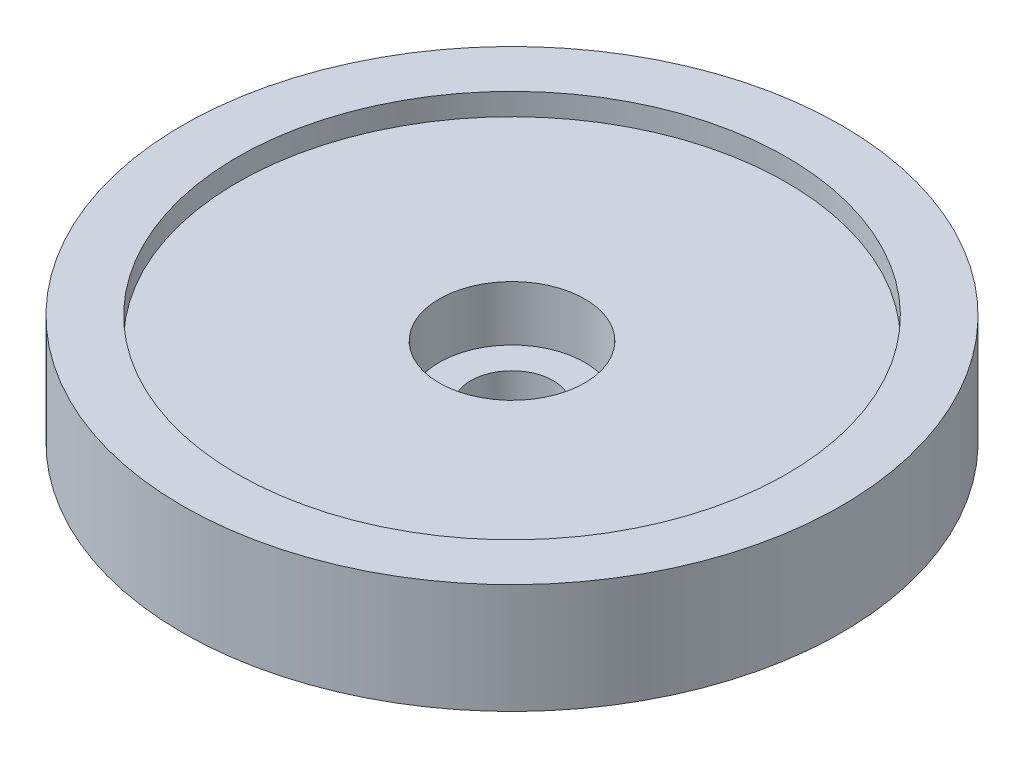
ISO-10303-21;
HEADER;
FILE_DESCRIPTION(('STEP AP214'),'2;1');
FILE_NAME('part.step','',(''),(''),'','','');
FILE_SCHEMA(('AUTOMOTIVE_DESIGN { 1 0 10303 214 1 1 1 1 }'));
ENDSEC;
DATA;
#1=APPLICATION_CONTEXT('core data for automotive mechanical design processes');
#2=APPLICATION_PROTOCOL_DEFINITION('international standard','automotive_design',2000,#1);
#3=PRODUCT_CONTEXT('',#1,'mechanical');
#4=PRODUCT('Part','Part','',(#3));
#5=PRODUCT_RELATED_PRODUCT_CATEGORY('part','',(#4));
#6=PRODUCT_DEFINITION_FORMATION('','',#4);
#7=PRODUCT_DEFINITION_CONTEXT('part definition',#1,'design');
#8=PRODUCT_DEFINITION('design','',#6,#7);
#9=PRODUCT_DEFINITION_SHAPE('','',#8);
#10=(LENGTH_UNIT() NAMED_UNIT(*) SI_UNIT(.MILLI.,.METRE.));
#11=(NAMED_UNIT(*) PLANE_ANGLE_UNIT() SI_UNIT($,.RADIAN.));
#12=(NAMED_UNIT(*) SI_UNIT($,.STERADIAN.) SOLID_ANGLE_UNIT());
#13=UNCERTAINTY_MEASURE_WITH_UNIT(LENGTH_MEASURE(1.E-05),#10,'distance_accuracy_value','');
#14=(GEOMETRIC_REPRESENTATION_CONTEXT(3) GLOBAL_UNCERTAINTY_ASSIGNED_CONTEXT((#13)) GLOBAL_UNIT_ASSIGNED_CONTEXT((#10,
#11,#12)) REPRESENTATION_CONTEXT('',''));
#15=CARTESIAN_POINT('',(0.,0.,0.));
#16=DIRECTION('',(0.,0.,1.));
#17=DIRECTION('',(1.,0.,0.));
#18=AXIS2_PLACEMENT_3D('',#15,#16,#17);
#19=CARTESIAN_POINT('',(0.,10.,0.));
#20=DIRECTION('',(0.,-1.,0.));
#21=DIRECTION('',(0.,0.,-1.));
#22=AXIS2_PLACEMENT_3D('',#19,#20,#21);
#23=CYLINDRICAL_SURFACE('',#22,30.);
#24=CARTESIAN_POINT('',(0.,10.,0.));
#25=DIRECTION('',(0.,1.,0.));
#26=DIRECTION('',(0.,0.,1.));
#27=AXIS2_PLACEMENT_3D('',#24,#25,#26);
#28=CIRCLE('',#27,30.);
#29=CARTESIAN_POINT('',(0.,10.,30.));
#30=VERTEX_POINT('',#29);
#31=EDGE_CURVE('E10',#30,#30,#28,.T.);
#32=ORIENTED_EDGE('',*,*,#31,.F.);
#33=EDGE_LOOP('',(#32));
#34=FACE_BOUND('',#33,.T.);
#35=CARTESIAN_POINT('',(0.,0.,0.));
#36=DIRECTION('',(0.,1.,0.));
#37=DIRECTION('',(0.,0.,1.));
#38=AXIS2_PLACEMENT_3D('',#35,#36,#37);
#39=CIRCLE('',#38,30.);
#40=CARTESIAN_POINT('',(0.,0.,30.));
#41=VERTEX_POINT('',#40);
#42=EDGE_CURVE('E45',#41,#41,#39,.T.);
#43=ORIENTED_EDGE('',*,*,#42,.T.);
#44=EDGE_LOOP('',(#43));
#45=FACE_BOUND('',#44,.T.);
#46=ADVANCED_FACE('F37',(#34,#45),#23,.T.);
#47=CARTESIAN_POINT('',(0.,10.,0.));
#48=DIRECTION('',(0.,1.,0.));
#49=DIRECTION('',(0.,0.,1.));
#50=AXIS2_PLACEMENT_3D('',#47,#48,#49);
#51=PLANE('',#50);
#52=CARTESIAN_POINT('',(0.,10.,0.));
#53=DIRECTION('',(0.,1.,0.));
#54=DIRECTION('',(0.,0.,1.));
#55=AXIS2_PLACEMENT_3D('',#52,#53,#54);
#56=CIRCLE('',#55,25.);
#57=CARTESIAN_POINT('',(0.,10.,25.));
#58=VERTEX_POINT('',#57);
#59=EDGE_CURVE('E53',#58,#58,#56,.T.);
#60=ORIENTED_EDGE('',*,*,#59,.F.);
#61=EDGE_LOOP('',(#60));
#62=FACE_BOUND('',#61,.T.);
#63=ORIENTED_EDGE('',*,*,#31,.T.);
#64=EDGE_LOOP('',(#63));
#65=FACE_BOUND('',#64,.T.);
#66=ADVANCED_FACE('F105',(#62,#65),#51,.T.);
#67=CARTESIAN_POINT('',(0.,0.,0.));
#68=DIRECTION('',(0.,1.,0.));
#69=DIRECTION('',(0.,0.,1.));
#70=AXIS2_PLACEMENT_3D('',#67,#68,#69);
#71=PLANE('',#70);
#72=CARTESIAN_POINT('',(0.,0.,0.));
#73=DIRECTION('',(0.,1.,0.));
#74=DIRECTION('',(0.,0.,1.));
#75=AXIS2_PLACEMENT_3D('',#72,#73,#74);
#76=CIRCLE('',#75,3.75);
#77=CARTESIAN_POINT('',(0.,0.,3.75));
#78=VERTEX_POINT('',#77);
#79=EDGE_CURVE('E68',#78,#78,#76,.T.);
#80=ORIENTED_EDGE('',*,*,#79,.T.);
#81=EDGE_LOOP('',(#80));
#82=FACE_BOUND('',#81,.T.);
#83=ORIENTED_EDGE('',*,*,#42,.F.);
#84=EDGE_LOOP('',(#83));
#85=FACE_BOUND('',#84,.T.);
#86=ADVANCED_FACE('F101',(#82,#85),#71,.F.);
#87=CARTESIAN_POINT('',(0.,8.,0.));
#88=DIRECTION('',(0.,1.,0.));
#89=DIRECTION('',(0.,0.,1.));
#90=AXIS2_PLACEMENT_3D('',#87,#88,#89);
#91=CYLINDRICAL_SURFACE('',#90,25.);
#92=CARTESIAN_POINT('',(0.,8.,0.));
#93=DIRECTION('',(0.,1.,0.));
#94=DIRECTION('',(0.,0.,1.));
#95=AXIS2_PLACEMENT_3D('',#92,#93,#94);
#96=CIRCLE('',#95,25.);
#97=CARTESIAN_POINT('',(0.,8.,25.));
#98=VERTEX_POINT('',#97);
#99=EDGE_CURVE('E51',#98,#98,#96,.T.);
#100=ORIENTED_EDGE('',*,*,#99,.F.);
#101=EDGE_LOOP('',(#100));
#102=FACE_BOUND('',#101,.T.);
#103=ORIENTED_EDGE('',*,*,#59,.T.);
#104=EDGE_LOOP('',(#103));
#105=FACE_BOUND('',#104,.T.);
#106=ADVANCED_FACE('F95',(#102,#105),#91,.F.);
#107=CARTESIAN_POINT('',(0.,8.,0.));
#108=DIRECTION('',(0.,1.,0.));
#109=DIRECTION('',(0.,0.,1.));
#110=AXIS2_PLACEMENT_3D('',#107,#108,#109);
#111=PLANE('',#110);
#112=CARTESIAN_POINT('',(0.,8.,0.));
#113=DIRECTION('',(0.,1.,0.));
#114=DIRECTION('',(0.,0.,1.));
#115=AXIS2_PLACEMENT_3D('',#112,#113,#114);
#116=CIRCLE('',#115,6.625);
#117=CARTESIAN_POINT('',(0.,8.,6.625));
#118=VERTEX_POINT('',#117);
#119=EDGE_CURVE('E61',#118,#118,#116,.T.);
#120=ORIENTED_EDGE('',*,*,#119,.F.);
#121=EDGE_LOOP('',(#120));
#122=FACE_BOUND('',#121,.T.);
#123=ORIENTED_EDGE('',*,*,#99,.T.);
#124=EDGE_LOOP('',(#123));
#125=FACE_BOUND('',#124,.T.);
#126=ADVANCED_FACE('F89',(#122,#125),#111,.T.);
#127=CARTESIAN_POINT('',(0.,3.,0.));
#128=DIRECTION('',(0.,1.,0.));
#129=DIRECTION('',(0.,0.,1.));
#130=AXIS2_PLACEMENT_3D('',#127,#128,#129);
#131=CYLINDRICAL_SURFACE('',#130,6.625);
#132=CARTESIAN_POINT('',(0.,3.,0.));
#133=DIRECTION('',(0.,1.,0.));
#134=DIRECTION('',(0.,0.,1.));
#135=AXIS2_PLACEMENT_3D('',#132,#133,#134);
#136=CIRCLE('',#135,6.625);
#137=CARTESIAN_POINT('',(0.,3.,6.625));
#138=VERTEX_POINT('',#137);
#139=EDGE_CURVE('E57',#138,#138,#136,.T.);
#140=ORIENTED_EDGE('',*,*,#139,.F.);
#141=EDGE_LOOP('',(#140));
#142=FACE_BOUND('',#141,.T.);
#143=ORIENTED_EDGE('',*,*,#119,.T.);
#144=EDGE_LOOP('',(#143));
#145=FACE_BOUND('',#144,.T.);
#146=ADVANCED_FACE('F83',(#142,#145),#131,.F.);
#147=CARTESIAN_POINT('',(0.,3.,0.));
#148=DIRECTION('',(0.,1.,0.));
#149=DIRECTION('',(0.,0.,1.));
#150=AXIS2_PLACEMENT_3D('',#147,#148,#149);
#151=PLANE('',#150);
#152=CARTESIAN_POINT('',(0.,3.,0.));
#153=DIRECTION('',(0.,1.,0.));
#154=DIRECTION('',(0.,0.,1.));
#155=AXIS2_PLACEMENT_3D('',#152,#153,#154);
#156=CIRCLE('',#155,3.75);
#157=CARTESIAN_POINT('',(0.,3.,3.75));
#158=VERTEX_POINT('',#157);
#159=EDGE_CURVE('E40',#158,#158,#156,.T.);
#160=ORIENTED_EDGE('',*,*,#159,.F.);
#161=EDGE_LOOP('',(#160));
#162=FACE_BOUND('',#161,.T.);
#163=ORIENTED_EDGE('',*,*,#139,.T.);
#164=EDGE_LOOP('',(#163));
#165=FACE_BOUND('',#164,.T.);
#166=ADVANCED_FACE('F80',(#162,#165),#151,.T.);
#167=CARTESIAN_POINT('',(0.,0.,0.));
#168=DIRECTION('',(0.,1.,0.));
#169=DIRECTION('',(0.,0.,1.));
#170=AXIS2_PLACEMENT_3D('',#167,#168,#169);
#171=CYLINDRICAL_SURFACE('',#170,3.75);
#172=ORIENTED_EDGE('',*,*,#159,.T.);
#173=EDGE_LOOP('',(#172));
#174=FACE_BOUND('',#173,.T.);
#175=ORIENTED_EDGE('',*,*,#79,.F.);
#176=EDGE_LOOP('',(#175));
#177=FACE_BOUND('',#176,.T.);
#178=ADVANCED_FACE('F77',(#174,#177),#171,.F.);
#179=CLOSED_SHELL('',(#46,#66,#86,#106,#126,#146,#166,#178));
#180=MANIFOLD_SOLID_BREP('B2',#179);
#181=ADVANCED_BREP_SHAPE_REPRESENTATION('',(#18,#180),#14);
#182=SHAPE_DEFINITION_REPRESENTATION(#9,#181);
ENDSEC;
END-ISO-10303-21;
